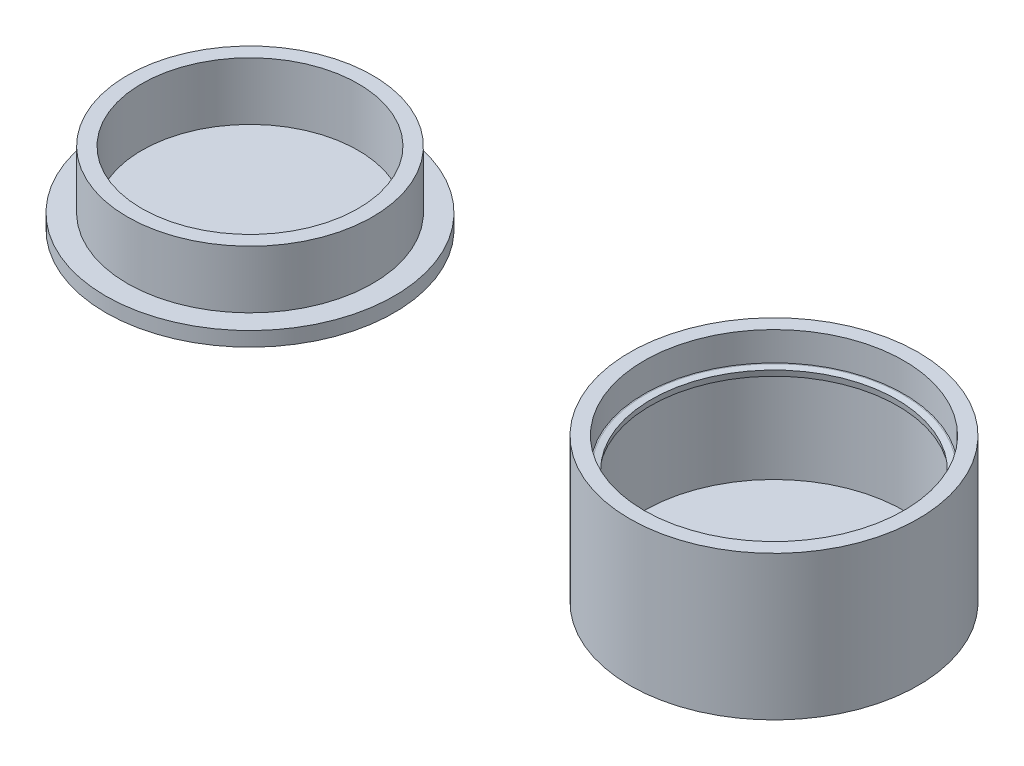
ISO-10303-21;
HEADER;
FILE_DESCRIPTION(('STEP AP214'),'2;1');
FILE_NAME('part.step','',(''),(''),'','','');
FILE_SCHEMA(('AUTOMOTIVE_DESIGN { 1 0 10303 214 1 1 1 1 }'));
ENDSEC;
DATA;
#1=APPLICATION_CONTEXT('core data for automotive mechanical design processes');
#2=APPLICATION_PROTOCOL_DEFINITION('international standard','automotive_design',2000,#1);
#3=PRODUCT_CONTEXT('',#1,'mechanical');
#4=PRODUCT('Part','Part','',(#3));
#5=PRODUCT_RELATED_PRODUCT_CATEGORY('part','',(#4));
#6=PRODUCT_DEFINITION_FORMATION('','',#4);
#7=PRODUCT_DEFINITION_CONTEXT('part definition',#1,'design');
#8=PRODUCT_DEFINITION('design','',#6,#7);
#9=PRODUCT_DEFINITION_SHAPE('','',#8);
#10=(LENGTH_UNIT() NAMED_UNIT(*) SI_UNIT(.MILLI.,.METRE.));
#11=(NAMED_UNIT(*) PLANE_ANGLE_UNIT() SI_UNIT($,.RADIAN.));
#12=(NAMED_UNIT(*) SI_UNIT($,.STERADIAN.) SOLID_ANGLE_UNIT());
#13=UNCERTAINTY_MEASURE_WITH_UNIT(LENGTH_MEASURE(1.E-05),#10,'distance_accuracy_value','');
#14=(GEOMETRIC_REPRESENTATION_CONTEXT(3) GLOBAL_UNCERTAINTY_ASSIGNED_CONTEXT((#13)) GLOBAL_UNIT_ASSIGNED_CONTEXT((#10,
#11,#12)) REPRESENTATION_CONTEXT('',''));
#15=CARTESIAN_POINT('',(0.,0.,0.));
#16=DIRECTION('',(0.,0.,1.));
#17=DIRECTION('',(1.,0.,0.));
#18=AXIS2_PLACEMENT_3D('',#15,#16,#17);
#19=CARTESIAN_POINT('',(-81.0658225170211,2.,-8.42859359668277));
#20=DIRECTION('',(0.,-1.,0.));
#21=DIRECTION('',(0.,0.,-1.));
#22=AXIS2_PLACEMENT_3D('',#19,#20,#21);
#23=CYLINDRICAL_SURFACE('',#22,20.);
#24=CARTESIAN_POINT('',(-81.0658225170211,2.,-8.42859359668277));
#25=DIRECTION('',(0.,1.,0.));
#26=DIRECTION('',(0.,0.,1.));
#27=AXIS2_PLACEMENT_3D('',#24,#25,#26);
#28=CIRCLE('',#27,20.);
#29=CARTESIAN_POINT('',(-81.0658225170211,2.,11.5714064033172));
#30=VERTEX_POINT('',#29);
#31=EDGE_CURVE('E59',#30,#30,#28,.T.);
#32=ORIENTED_EDGE('',*,*,#31,.F.);
#33=EDGE_LOOP('',(#32));
#34=FACE_BOUND('',#33,.T.);
#35=CARTESIAN_POINT('',(-81.0658225170211,0.,-8.42859359668277));
#36=DIRECTION('',(0.,1.,0.));
#37=DIRECTION('',(0.,0.,1.));
#38=AXIS2_PLACEMENT_3D('',#35,#36,#37);
#39=CIRCLE('',#38,20.);
#40=CARTESIAN_POINT('',(-81.0658225170211,0.,11.5714064033172));
#41=VERTEX_POINT('',#40);
#42=EDGE_CURVE('E63',#41,#41,#39,.T.);
#43=ORIENTED_EDGE('',*,*,#42,.T.);
#44=EDGE_LOOP('',(#43));
#45=FACE_BOUND('',#44,.T.);
#46=ADVANCED_FACE('F53',(#34,#45),#23,.T.);
#47=CARTESIAN_POINT('',(-81.0658225170211,2.,-8.42859359668277));
#48=DIRECTION('',(0.,1.,0.));
#49=DIRECTION('',(0.,0.,1.));
#50=AXIS2_PLACEMENT_3D('',#47,#48,#49);
#51=PLANE('',#50);
#52=CARTESIAN_POINT('',(-81.0658225170211,2.,-8.42859359668277));
#53=DIRECTION('',(0.,1.,0.));
#54=DIRECTION('',(0.,0.,1.));
#55=AXIS2_PLACEMENT_3D('',#52,#53,#54);
#56=CIRCLE('',#55,17.);
#57=CARTESIAN_POINT('',(-81.0658225170211,2.,8.57140640331722));
#58=VERTEX_POINT('',#57);
#59=EDGE_CURVE('E70',#58,#58,#56,.T.);
#60=ORIENTED_EDGE('',*,*,#59,.F.);
#61=EDGE_LOOP('',(#60));
#62=FACE_BOUND('',#61,.T.);
#63=ORIENTED_EDGE('',*,*,#31,.T.);
#64=EDGE_LOOP('',(#63));
#65=FACE_BOUND('',#64,.T.);
#66=ADVANCED_FACE('F93',(#62,#65),#51,.T.);
#67=CARTESIAN_POINT('',(-81.0658225170211,0.,-8.42859359668277));
#68=DIRECTION('',(0.,1.,0.));
#69=DIRECTION('',(0.,0.,1.));
#70=AXIS2_PLACEMENT_3D('',#67,#68,#69);
#71=PLANE('',#70);
#72=ORIENTED_EDGE('',*,*,#42,.F.);
#73=EDGE_LOOP('',(#72));
#74=FACE_BOUND('',#73,.T.);
#75=ADVANCED_FACE('F84',(#74),#71,.F.);
#76=CARTESIAN_POINT('',(-81.0658225170211,10.,-8.42859359668277));
#77=DIRECTION('',(0.,1.,0.));
#78=DIRECTION('',(0.,0.,1.));
#79=AXIS2_PLACEMENT_3D('',#76,#77,#78);
#80=PLANE('',#79);
#81=CARTESIAN_POINT('',(-81.0658225170211,10.,-8.42859359668277));
#82=DIRECTION('',(0.,1.,0.));
#83=DIRECTION('',(0.,0.,1.));
#84=AXIS2_PLACEMENT_3D('',#81,#82,#83);
#85=CIRCLE('',#84,17.);
#86=CARTESIAN_POINT('',(-81.0658225170211,10.,8.57140640331722));
#87=VERTEX_POINT('',#86);
#88=EDGE_CURVE('E68',#87,#87,#85,.T.);
#89=ORIENTED_EDGE('',*,*,#88,.T.);
#90=EDGE_LOOP('',(#89));
#91=FACE_BOUND('',#90,.T.);
#92=CARTESIAN_POINT('',(-81.0658225170211,10.,-8.42859359668277));
#93=DIRECTION('',(0.,1.,0.));
#94=DIRECTION('',(0.,0.,1.));
#95=AXIS2_PLACEMENT_3D('',#92,#93,#94);
#96=CIRCLE('',#95,15.);
#97=CARTESIAN_POINT('',(-81.0658225170211,10.,6.57140640331723));
#98=VERTEX_POINT('',#97);
#99=EDGE_CURVE('E73',#98,#98,#96,.T.);
#100=ORIENTED_EDGE('',*,*,#99,.F.);
#101=EDGE_LOOP('',(#100));
#102=FACE_BOUND('',#101,.T.);
#103=ADVANCED_FACE('F81',(#91,#102),#80,.T.);
#104=CARTESIAN_POINT('',(-81.0658225170211,10.,-8.42859359668277));
#105=DIRECTION('',(0.,-1.,0.));
#106=DIRECTION('',(0.,0.,-1.));
#107=AXIS2_PLACEMENT_3D('',#104,#105,#106);
#108=CYLINDRICAL_SURFACE('',#107,17.);
#109=ORIENTED_EDGE('',*,*,#88,.F.);
#110=EDGE_LOOP('',(#109));
#111=FACE_BOUND('',#110,.T.);
#112=ORIENTED_EDGE('',*,*,#59,.T.);
#113=EDGE_LOOP('',(#112));
#114=FACE_BOUND('',#113,.T.);
#115=ADVANCED_FACE('F83',(#111,#114),#108,.T.);
#116=CARTESIAN_POINT('',(-81.0658225170211,10.,-8.42859359668277));
#117=DIRECTION('',(0.,-1.,0.));
#118=DIRECTION('',(0.,0.,-1.));
#119=AXIS2_PLACEMENT_3D('',#116,#117,#118);
#120=CYLINDRICAL_SURFACE('',#119,15.);
#121=ORIENTED_EDGE('',*,*,#99,.T.);
#122=EDGE_LOOP('',(#121));
#123=FACE_BOUND('',#122,.T.);
#124=CARTESIAN_POINT('',(-81.0658225170211,2.,-8.42859359668277));
#125=DIRECTION('',(0.,1.,0.));
#126=DIRECTION('',(0.,0.,1.));
#127=AXIS2_PLACEMENT_3D('',#124,#125,#126);
#128=CIRCLE('',#127,15.);
#129=CARTESIAN_POINT('',(-81.0658225170211,2.,6.57140640331723));
#130=VERTEX_POINT('',#129);
#131=EDGE_CURVE('E11',#130,#130,#128,.F.);
#132=ORIENTED_EDGE('',*,*,#131,.T.);
#133=EDGE_LOOP('',(#132));
#134=FACE_BOUND('',#133,.T.);
#135=ADVANCED_FACE('F79',(#123,#134),#120,.F.);
#136=ORIENTED_EDGE('',*,*,#131,.F.);
#137=EDGE_LOOP('',(#136));
#138=FACE_BOUND('',#137,.T.);
#139=ADVANCED_FACE('F103',(#138),#51,.T.);
#140=CLOSED_SHELL('',(#46,#66,#75,#103,#115,#135,#139));
#141=MANIFOLD_SOLID_BREP('B2',#140);
#142=CARTESIAN_POINT('',(0.,20.,0.));
#143=DIRECTION('',(0.,-1.,0.));
#144=DIRECTION('',(0.,0.,-1.));
#145=AXIS2_PLACEMENT_3D('',#142,#143,#144);
#146=CYLINDRICAL_SURFACE('',#145,20.);
#147=CARTESIAN_POINT('',(0.,20.,0.));
#148=DIRECTION('',(0.,1.,0.));
#149=DIRECTION('',(0.,0.,1.));
#150=AXIS2_PLACEMENT_3D('',#147,#148,#149);
#151=CIRCLE('',#150,20.);
#152=CARTESIAN_POINT('',(0.,20.,20.));
#153=VERTEX_POINT('',#152);
#154=EDGE_CURVE('E192',#153,#153,#151,.T.);
#155=ORIENTED_EDGE('',*,*,#154,.F.);
#156=EDGE_LOOP('',(#155));
#157=FACE_BOUND('',#156,.T.);
#158=CARTESIAN_POINT('',(0.,0.,0.));
#159=DIRECTION('',(0.,1.,0.));
#160=DIRECTION('',(0.,0.,1.));
#161=AXIS2_PLACEMENT_3D('',#158,#159,#160);
#162=CIRCLE('',#161,20.);
#163=CARTESIAN_POINT('',(0.,0.,20.));
#164=VERTEX_POINT('',#163);
#165=EDGE_CURVE('E193',#164,#164,#162,.T.);
#166=ORIENTED_EDGE('',*,*,#165,.T.);
#167=EDGE_LOOP('',(#166));
#168=FACE_BOUND('',#167,.T.);
#169=ADVANCED_FACE('F167',(#157,#168),#146,.T.);
#170=CARTESIAN_POINT('',(0.,20.,0.));
#171=DIRECTION('',(0.,1.,0.));
#172=DIRECTION('',(0.,0.,1.));
#173=AXIS2_PLACEMENT_3D('',#170,#171,#172);
#174=PLANE('',#173);
#175=CARTESIAN_POINT('',(0.,20.,0.));
#176=DIRECTION('',(0.,1.,0.));
#177=DIRECTION('',(0.,0.,1.));
#178=AXIS2_PLACEMENT_3D('',#175,#176,#177);
#179=CIRCLE('',#178,18.);
#180=CARTESIAN_POINT('',(0.,20.,18.));
#181=VERTEX_POINT('',#180);
#182=EDGE_CURVE('E201',#181,#181,#179,.T.);
#183=ORIENTED_EDGE('',*,*,#182,.F.);
#184=EDGE_LOOP('',(#183));
#185=FACE_BOUND('',#184,.T.);
#186=ORIENTED_EDGE('',*,*,#154,.T.);
#187=EDGE_LOOP('',(#186));
#188=FACE_BOUND('',#187,.T.);
#189=ADVANCED_FACE('F238',(#185,#188),#174,.T.);
#190=CARTESIAN_POINT('',(0.,0.,0.));
#191=DIRECTION('',(0.,1.,0.));
#192=DIRECTION('',(0.,0.,1.));
#193=AXIS2_PLACEMENT_3D('',#190,#191,#192);
#194=PLANE('',#193);
#195=ORIENTED_EDGE('',*,*,#165,.F.);
#196=EDGE_LOOP('',(#195));
#197=FACE_BOUND('',#196,.T.);
#198=ADVANCED_FACE('F244',(#197),#194,.F.);
#199=CARTESIAN_POINT('',(0.,16.,0.));
#200=DIRECTION('',(0.,1.,0.));
#201=DIRECTION('',(0.,0.,1.));
#202=AXIS2_PLACEMENT_3D('',#199,#200,#201);
#203=CYLINDRICAL_SURFACE('',#202,18.);
#204=CARTESIAN_POINT('',(0.,16.,0.));
#205=DIRECTION('',(0.,1.,0.));
#206=DIRECTION('',(0.,0.,1.));
#207=AXIS2_PLACEMENT_3D('',#204,#205,#206);
#208=CIRCLE('',#207,18.);
#209=CARTESIAN_POINT('',(0.,16.,18.));
#210=VERTEX_POINT('',#209);
#211=EDGE_CURVE('E197',#210,#210,#208,.T.);
#212=ORIENTED_EDGE('',*,*,#211,.F.);
#213=EDGE_LOOP('',(#212));
#214=FACE_BOUND('',#213,.T.);
#215=ORIENTED_EDGE('',*,*,#182,.T.);
#216=EDGE_LOOP('',(#215));
#217=FACE_BOUND('',#216,.T.);
#218=ADVANCED_FACE('F256',(#214,#217),#203,.F.);
#219=CARTESIAN_POINT('',(0.,16.,0.));
#220=DIRECTION('',(0.,1.,0.));
#221=DIRECTION('',(0.,0.,1.));
#222=AXIS2_PLACEMENT_3D('',#219,#220,#221);
#223=PLANE('',#222);
#224=CARTESIAN_POINT('',(0.,16.,0.));
#225=DIRECTION('',(0.,1.,0.));
#226=DIRECTION('',(0.,0.,1.));
#227=AXIS2_PLACEMENT_3D('',#224,#225,#226);
#228=CIRCLE('',#227,17.85);
#229=CARTESIAN_POINT('',(0.,16.,17.85));
#230=VERTEX_POINT('',#229);
#231=EDGE_CURVE('E52',#230,#230,#228,.F.);
#232=ORIENTED_EDGE('',*,*,#231,.T.);
#233=EDGE_LOOP('',(#232));
#234=FACE_BOUND('',#233,.T.);
#235=ORIENTED_EDGE('',*,*,#211,.T.);
#236=EDGE_LOOP('',(#235));
#237=FACE_BOUND('',#236,.T.);
#238=ADVANCED_FACE('F261',(#234,#237),#223,.T.);
#239=CARTESIAN_POINT('',(0.,15.,0.));
#240=DIRECTION('',(0.,1.,0.));
#241=DIRECTION('',(0.,0.,1.));
#242=AXIS2_PLACEMENT_3D('',#239,#240,#241);
#243=CYLINDRICAL_SURFACE('',#242,17.);
#244=CARTESIAN_POINT('',(0.,15.85,0.));
#245=DIRECTION('',(0.,1.,0.));
#246=DIRECTION('',(0.,0.,1.));
#247=AXIS2_PLACEMENT_3D('',#244,#245,#246);
#248=CIRCLE('',#247,17.);
#249=CARTESIAN_POINT('',(0.,15.85,17.));
#250=VERTEX_POINT('',#249);
#251=EDGE_CURVE('E176',#250,#250,#248,.F.);
#252=ORIENTED_EDGE('',*,*,#251,.T.);
#253=EDGE_LOOP('',(#252));
#254=FACE_BOUND('',#253,.T.);
#255=CARTESIAN_POINT('',(0.,15.8501220663978,0.));
#256=DIRECTION('',(0.,1.,0.));
#257=DIRECTION('',(0.,0.,1.));
#258=AXIS2_PLACEMENT_3D('',#255,#256,#257);
#259=CIRCLE('',#258,17.);
#260=CARTESIAN_POINT('',(0.,15.8501220663978,17.));
#261=VERTEX_POINT('',#260);
#262=EDGE_CURVE('E181',#261,#261,#259,.T.);
#263=ORIENTED_EDGE('',*,*,#262,.T.);
#264=EDGE_LOOP('',(#263));
#265=FACE_BOUND('',#264,.T.);
#266=ADVANCED_FACE('F222',(#254,#265),#243,.F.);
#267=CARTESIAN_POINT('',(0.,2.,0.));
#268=DIRECTION('',(0.,1.,0.));
#269=DIRECTION('',(0.,0.,1.));
#270=AXIS2_PLACEMENT_3D('',#267,#268,#269);
#271=CYLINDRICAL_SURFACE('',#270,18.);
#272=CARTESIAN_POINT('',(0.,2.,0.));
#273=DIRECTION('',(0.,1.,0.));
#274=DIRECTION('',(0.,0.,1.));
#275=AXIS2_PLACEMENT_3D('',#272,#273,#274);
#276=CIRCLE('',#275,18.);
#277=CARTESIAN_POINT('',(0.,2.,18.));
#278=VERTEX_POINT('',#277);
#279=EDGE_CURVE('E205',#278,#278,#276,.T.);
#280=ORIENTED_EDGE('',*,*,#279,.F.);
#281=EDGE_LOOP('',(#280));
#282=FACE_BOUND('',#281,.T.);
#283=CARTESIAN_POINT('',(0.,15.,0.));
#284=DIRECTION('',(0.,1.,0.));
#285=DIRECTION('',(0.,0.,1.));
#286=AXIS2_PLACEMENT_3D('',#283,#284,#285);
#287=CIRCLE('',#286,18.);
#288=CARTESIAN_POINT('',(0.,15.,18.));
#289=VERTEX_POINT('',#288);
#290=EDGE_CURVE('E209',#289,#289,#287,.T.);
#291=ORIENTED_EDGE('',*,*,#290,.T.);
#292=EDGE_LOOP('',(#291));
#293=FACE_BOUND('',#292,.T.);
#294=ADVANCED_FACE('F219',(#282,#293),#271,.F.);
#295=CARTESIAN_POINT('',(0.,2.,0.));
#296=DIRECTION('',(0.,1.,0.));
#297=DIRECTION('',(0.,0.,1.));
#298=AXIS2_PLACEMENT_3D('',#295,#296,#297);
#299=PLANE('',#298);
#300=ORIENTED_EDGE('',*,*,#279,.T.);
#301=EDGE_LOOP('',(#300));
#302=FACE_BOUND('',#301,.T.);
#303=ADVANCED_FACE('F217',(#302),#299,.T.);
#304=CARTESIAN_POINT('',(0.,15.,0.));
#305=DIRECTION('',(0.,1.,0.));
#306=DIRECTION('',(0.,0.,1.));
#307=AXIS2_PLACEMENT_3D('',#304,#305,#306);
#308=PLANE('',#307);
#309=CARTESIAN_POINT('',(0.,15.,0.));
#310=DIRECTION('',(0.,1.,0.));
#311=DIRECTION('',(0.,0.,1.));
#312=AXIS2_PLACEMENT_3D('',#309,#310,#311);
#313=CIRCLE('',#312,17.1498779336022);
#314=CARTESIAN_POINT('',(0.,15.,17.1498779336022));
#315=VERTEX_POINT('',#314);
#316=EDGE_CURVE('E186',#315,#315,#313,.T.);
#317=ORIENTED_EDGE('',*,*,#316,.T.);
#318=EDGE_LOOP('',(#317));
#319=FACE_BOUND('',#318,.T.);
#320=ORIENTED_EDGE('',*,*,#290,.F.);
#321=EDGE_LOOP('',(#320));
#322=FACE_BOUND('',#321,.T.);
#323=ADVANCED_FACE('F226',(#319,#322),#308,.F.);
#324=CARTESIAN_POINT('',(0.,15.,0.));
#325=DIRECTION('',(0.,-1.,0.));
#326=DIRECTION('',(0.,0.,-1.));
#327=AXIS2_PLACEMENT_3D('',#324,#325,#326);
#328=CONICAL_SURFACE('',#327,17.1498779336022,0.174532925199428);
#329=ORIENTED_EDGE('',*,*,#251,.F.);
#330=EDGE_LOOP('',(#329));
#331=FACE_BOUND('',#330,.T.);
#332=ORIENTED_EDGE('',*,*,#316,.F.);
#333=EDGE_LOOP('',(#332));
#334=FACE_BOUND('',#333,.T.);
#335=ADVANCED_FACE('F228',(#331,#334),#328,.F.);
#336=CARTESIAN_POINT('',(0.,15.8501220663978,0.));
#337=DIRECTION('',(0.,1.,0.));
#338=DIRECTION('',(0.,0.,1.));
#339=AXIS2_PLACEMENT_3D('',#336,#337,#338);
#340=CONICAL_SURFACE('',#339,17.,1.39626340159546);
#341=ORIENTED_EDGE('',*,*,#231,.F.);
#342=EDGE_LOOP('',(#341));
#343=FACE_BOUND('',#342,.T.);
#344=ORIENTED_EDGE('',*,*,#262,.F.);
#345=EDGE_LOOP('',(#344));
#346=FACE_BOUND('',#345,.T.);
#347=ADVANCED_FACE('F170',(#343,#346),#340,.F.);
#348=CLOSED_SHELL('',(#169,#189,#198,#218,#238,#266,#294,#303,#323,#335,#347));
#349=MANIFOLD_SOLID_BREP('B6',#348);
#350=ADVANCED_BREP_SHAPE_REPRESENTATION('',(#18,#141,#349),#14);
#351=SHAPE_DEFINITION_REPRESENTATION(#9,#350);
ENDSEC;
END-ISO-10303-21;
